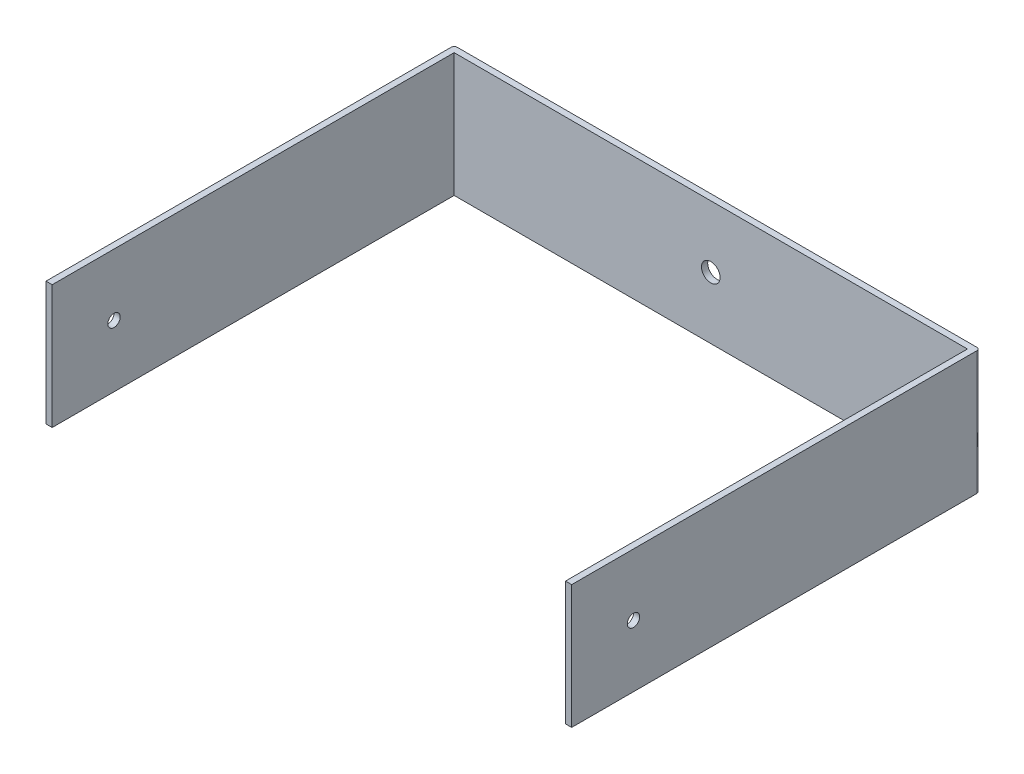
ISO-10303-21;
HEADER;
FILE_DESCRIPTION(('STEP AP214'),'2;1');
FILE_NAME('part.step','',(''),(''),'','','');
FILE_SCHEMA(('AUTOMOTIVE_DESIGN { 1 0 10303 214 1 1 1 1 }'));
ENDSEC;
DATA;
#1=APPLICATION_CONTEXT('core data for automotive mechanical design processes');
#2=APPLICATION_PROTOCOL_DEFINITION('international standard','automotive_design',2000,#1);
#3=PRODUCT_CONTEXT('',#1,'mechanical');
#4=PRODUCT('Part','Part','',(#3));
#5=PRODUCT_RELATED_PRODUCT_CATEGORY('part','',(#4));
#6=PRODUCT_DEFINITION_FORMATION('','',#4);
#7=PRODUCT_DEFINITION_CONTEXT('part definition',#1,'design');
#8=PRODUCT_DEFINITION('design','',#6,#7);
#9=PRODUCT_DEFINITION_SHAPE('','',#8);
#10=(LENGTH_UNIT() NAMED_UNIT(*) SI_UNIT(.MILLI.,.METRE.));
#11=(NAMED_UNIT(*) PLANE_ANGLE_UNIT() SI_UNIT($,.RADIAN.));
#12=(NAMED_UNIT(*) SI_UNIT($,.STERADIAN.) SOLID_ANGLE_UNIT());
#13=UNCERTAINTY_MEASURE_WITH_UNIT(LENGTH_MEASURE(1.E-05),#10,'distance_accuracy_value','');
#14=(GEOMETRIC_REPRESENTATION_CONTEXT(3) GLOBAL_UNCERTAINTY_ASSIGNED_CONTEXT((#13)) GLOBAL_UNIT_ASSIGNED_CONTEXT((#10,
#11,#12)) REPRESENTATION_CONTEXT('',''));
#15=CARTESIAN_POINT('',(0.,0.,0.));
#16=DIRECTION('',(0.,0.,1.));
#17=DIRECTION('',(1.,0.,0.));
#18=AXIS2_PLACEMENT_3D('',#15,#16,#17);
#19=CARTESIAN_POINT('',(0.,0.,2.));
#20=DIRECTION('',(0.,0.,1.));
#21=DIRECTION('',(1.,0.,0.));
#22=AXIS2_PLACEMENT_3D('',#19,#20,#21);
#23=PLANE('',#22);
#24=CARTESIAN_POINT('',(85.,-20.,2.));
#25=DIRECTION('',(0.,0.,1.));
#26=DIRECTION('',(1.,0.,0.));
#27=AXIS2_PLACEMENT_3D('',#24,#25,#26);
#28=CIRCLE('',#27,3.00000000000001);
#29=CARTESIAN_POINT('',(88.,-20.,2.));
#30=VERTEX_POINT('',#29);
#31=EDGE_CURVE('E384',#30,#30,#28,.T.);
#32=ORIENTED_EDGE('',*,*,#31,.F.);
#33=EDGE_LOOP('',(#32));
#34=FACE_BOUND('',#33,.T.);
#35=DIRECTION('',(1.,0.,0.));
#36=VECTOR('',#35,1.);
#37=CARTESIAN_POINT('',(0.,-40.,2.));
#38=LINE('',#37,#36);
#39=CARTESIAN_POINT('',(2.,-40.,2.));
#40=VERTEX_POINT('',#39);
#41=CARTESIAN_POINT('',(168.,-40.,2.));
#42=VERTEX_POINT('',#41);
#43=EDGE_CURVE('E168',#40,#42,#38,.T.);
#44=ORIENTED_EDGE('',*,*,#43,.T.);
#45=DIRECTION('',(0.,-1.,0.));
#46=VECTOR('',#45,1.);
#47=CARTESIAN_POINT('',(168.,0.,2.));
#48=LINE('',#47,#46);
#49=CARTESIAN_POINT('',(168.,0.,2.));
#50=VERTEX_POINT('',#49);
#51=EDGE_CURVE('E134',#50,#42,#48,.T.);
#52=ORIENTED_EDGE('',*,*,#51,.F.);
#53=DIRECTION('',(-1.,0.,0.));
#54=VECTOR('',#53,1.);
#55=CARTESIAN_POINT('',(0.,0.,2.));
#56=LINE('',#55,#54);
#57=CARTESIAN_POINT('',(2.,0.,2.));
#58=VERTEX_POINT('',#57);
#59=EDGE_CURVE('E180',#50,#58,#56,.T.);
#60=ORIENTED_EDGE('',*,*,#59,.T.);
#61=DIRECTION('',(0.,1.,0.));
#62=VECTOR('',#61,1.);
#63=CARTESIAN_POINT('',(2.,0.,2.));
#64=LINE('',#63,#62);
#65=EDGE_CURVE('E148',#40,#58,#64,.T.);
#66=ORIENTED_EDGE('',*,*,#65,.F.);
#67=EDGE_LOOP('',(#44,#52,#60,#66));
#68=FACE_BOUND('',#67,.T.);
#69=ADVANCED_FACE('F32',(#34,#68),#23,.T.);
#70=CARTESIAN_POINT('',(0.,0.,2.));
#71=DIRECTION('',(1.,0.,0.));
#72=DIRECTION('',(0.,1.,0.));
#73=AXIS2_PLACEMENT_3D('',#70,#71,#72);
#74=PLANE('',#73);
#75=CARTESIAN_POINT('',(0.,-20.,112.));
#76=DIRECTION('',(-1.,0.,0.));
#77=DIRECTION('',(0.,-1.,0.));
#78=AXIS2_PLACEMENT_3D('',#75,#76,#77);
#79=CIRCLE('',#78,2.);
#80=CARTESIAN_POINT('',(0.,-22.,112.));
#81=VERTEX_POINT('',#80);
#82=EDGE_CURVE('E387',#81,#81,#79,.T.);
#83=ORIENTED_EDGE('',*,*,#82,.F.);
#84=EDGE_LOOP('',(#83));
#85=FACE_BOUND('',#84,.T.);
#86=DIRECTION('',(0.,0.,-1.));
#87=VECTOR('',#86,1.);
#88=CARTESIAN_POINT('',(0.,0.,2.));
#89=LINE('',#88,#87);
#90=CARTESIAN_POINT('',(0.,0.,132.));
#91=VERTEX_POINT('',#90);
#92=CARTESIAN_POINT('',(0.,0.,1.));
#93=VERTEX_POINT('',#92);
#94=EDGE_CURVE('E118',#91,#93,#89,.T.);
#95=ORIENTED_EDGE('',*,*,#94,.T.);
#96=DIRECTION('',(0.,-1.,0.));
#97=VECTOR('',#96,1.);
#98=CARTESIAN_POINT('',(0.,0.,1.));
#99=LINE('',#98,#97);
#100=CARTESIAN_POINT('',(0.,-40.,1.));
#101=VERTEX_POINT('',#100);
#102=EDGE_CURVE('E193',#93,#101,#99,.T.);
#103=ORIENTED_EDGE('',*,*,#102,.T.);
#104=DIRECTION('',(0.,0.,-1.));
#105=VECTOR('',#104,1.);
#106=CARTESIAN_POINT('',(0.,-40.,2.));
#107=LINE('',#106,#105);
#108=CARTESIAN_POINT('',(0.,-40.,132.));
#109=VERTEX_POINT('',#108);
#110=EDGE_CURVE('E191',#109,#101,#107,.T.);
#111=ORIENTED_EDGE('',*,*,#110,.F.);
#112=DIRECTION('',(0.,-1.,0.));
#113=VECTOR('',#112,1.);
#114=CARTESIAN_POINT('',(0.,0.,132.));
#115=LINE('',#114,#113);
#116=EDGE_CURVE('E149',#91,#109,#115,.T.);
#117=ORIENTED_EDGE('',*,*,#116,.F.);
#118=EDGE_LOOP('',(#95,#103,#111,#117));
#119=FACE_BOUND('',#118,.T.);
#120=ADVANCED_FACE('F214',(#85,#119),#74,.F.);
#121=CARTESIAN_POINT('',(0.,-40.,2.));
#122=DIRECTION('',(0.,1.,0.));
#123=DIRECTION('',(0.,0.,1.));
#124=AXIS2_PLACEMENT_3D('',#121,#122,#123);
#125=PLANE('',#124);
#126=DIRECTION('',(1.,0.,0.));
#127=VECTOR('',#126,1.);
#128=CARTESIAN_POINT('',(0.,-40.,0.));
#129=LINE('',#128,#127);
#130=CARTESIAN_POINT('',(1.00000000000001,-40.,0.));
#131=VERTEX_POINT('',#130);
#132=CARTESIAN_POINT('',(169.,-40.,0.));
#133=VERTEX_POINT('',#132);
#134=EDGE_CURVE('E177',#131,#133,#129,.T.);
#135=ORIENTED_EDGE('',*,*,#134,.T.);
#136=CARTESIAN_POINT('',(169.,-40.,1.));
#137=DIRECTION('',(0.,1.,0.));
#138=DIRECTION('',(0.,0.,1.));
#139=AXIS2_PLACEMENT_3D('',#136,#137,#138);
#140=CIRCLE('',#139,1.);
#141=CARTESIAN_POINT('',(170.,-40.,1.));
#142=VERTEX_POINT('',#141);
#143=EDGE_CURVE('E11',#133,#142,#140,.F.);
#144=ORIENTED_EDGE('',*,*,#143,.T.);
#145=DIRECTION('',(0.,0.,-1.));
#146=VECTOR('',#145,1.);
#147=CARTESIAN_POINT('',(170.,-40.,2.));
#148=LINE('',#147,#146);
#149=CARTESIAN_POINT('',(170.,-40.,132.));
#150=VERTEX_POINT('',#149);
#151=EDGE_CURVE('E117',#150,#142,#148,.T.);
#152=ORIENTED_EDGE('',*,*,#151,.F.);
#153=DIRECTION('',(1.,0.,0.));
#154=VECTOR('',#153,1.);
#155=CARTESIAN_POINT('',(170.,-40.,132.));
#156=LINE('',#155,#154);
#157=CARTESIAN_POINT('',(168.,-40.,132.));
#158=VERTEX_POINT('',#157);
#159=EDGE_CURVE('E133',#158,#150,#156,.T.);
#160=ORIENTED_EDGE('',*,*,#159,.F.);
#161=DIRECTION('',(0.,0.,-1.));
#162=VECTOR('',#161,1.);
#163=CARTESIAN_POINT('',(168.,-40.,132.));
#164=LINE('',#163,#162);
#165=EDGE_CURVE('E143',#158,#42,#164,.T.);
#166=ORIENTED_EDGE('',*,*,#165,.T.);
#167=ORIENTED_EDGE('',*,*,#43,.F.);
#168=DIRECTION('',(0.,0.,-1.));
#169=VECTOR('',#168,1.);
#170=CARTESIAN_POINT('',(2.00000000000001,-40.,132.));
#171=LINE('',#170,#169);
#172=CARTESIAN_POINT('',(2.00000000000001,-40.,132.));
#173=VERTEX_POINT('',#172);
#174=EDGE_CURVE('E172',#173,#40,#171,.T.);
#175=ORIENTED_EDGE('',*,*,#174,.F.);
#176=DIRECTION('',(1.,0.,0.));
#177=VECTOR('',#176,1.);
#178=CARTESIAN_POINT('',(0.,-40.,132.));
#179=LINE('',#178,#177);
#180=EDGE_CURVE('E152',#109,#173,#179,.T.);
#181=ORIENTED_EDGE('',*,*,#180,.F.);
#182=ORIENTED_EDGE('',*,*,#110,.T.);
#183=CARTESIAN_POINT('',(1.00000000000001,-40.,1.));
#184=DIRECTION('',(0.,1.,0.));
#185=DIRECTION('',(0.,0.,1.));
#186=AXIS2_PLACEMENT_3D('',#183,#184,#185);
#187=CIRCLE('',#186,1.);
#188=EDGE_CURVE('E197',#101,#131,#187,.F.);
#189=ORIENTED_EDGE('',*,*,#188,.T.);
#190=EDGE_LOOP('',(#135,#144,#152,#160,#166,#167,#175,#181,#182,#189));
#191=FACE_BOUND('',#190,.T.);
#192=ADVANCED_FACE('F216',(#191),#125,.F.);
#193=CARTESIAN_POINT('',(170.,0.,2.));
#194=DIRECTION('',(-1.,0.,0.));
#195=DIRECTION('',(0.,0.,1.));
#196=AXIS2_PLACEMENT_3D('',#193,#194,#195);
#197=PLANE('',#196);
#198=CARTESIAN_POINT('',(170.,-20.,112.));
#199=DIRECTION('',(-1.,0.,0.));
#200=DIRECTION('',(0.,-1.,0.));
#201=AXIS2_PLACEMENT_3D('',#198,#199,#200);
#202=CIRCLE('',#201,2.);
#203=CARTESIAN_POINT('',(170.,-22.,112.));
#204=VERTEX_POINT('',#203);
#205=EDGE_CURVE('E388',#204,#204,#202,.T.);
#206=ORIENTED_EDGE('',*,*,#205,.T.);
#207=EDGE_LOOP('',(#206));
#208=FACE_BOUND('',#207,.T.);
#209=ORIENTED_EDGE('',*,*,#151,.T.);
#210=DIRECTION('',(0.,1.,0.));
#211=VECTOR('',#210,1.);
#212=CARTESIAN_POINT('',(170.,0.,1.));
#213=LINE('',#212,#211);
#214=CARTESIAN_POINT('',(170.,0.,1.));
#215=VERTEX_POINT('',#214);
#216=EDGE_CURVE('E116',#142,#215,#213,.T.);
#217=ORIENTED_EDGE('',*,*,#216,.T.);
#218=DIRECTION('',(0.,0.,-1.));
#219=VECTOR('',#218,1.);
#220=CARTESIAN_POINT('',(170.,0.,2.));
#221=LINE('',#220,#219);
#222=CARTESIAN_POINT('',(170.,0.,132.));
#223=VERTEX_POINT('',#222);
#224=EDGE_CURVE('E109',#223,#215,#221,.T.);
#225=ORIENTED_EDGE('',*,*,#224,.F.);
#226=DIRECTION('',(0.,1.,0.));
#227=VECTOR('',#226,1.);
#228=CARTESIAN_POINT('',(170.,0.,132.));
#229=LINE('',#228,#227);
#230=EDGE_CURVE('E114',#150,#223,#229,.T.);
#231=ORIENTED_EDGE('',*,*,#230,.F.);
#232=EDGE_LOOP('',(#209,#217,#225,#231));
#233=FACE_BOUND('',#232,.T.);
#234=ADVANCED_FACE('F112',(#208,#233),#197,.F.);
#235=CARTESIAN_POINT('',(0.,0.,2.));
#236=DIRECTION('',(0.,-1.,0.));
#237=DIRECTION('',(0.,0.,-1.));
#238=AXIS2_PLACEMENT_3D('',#235,#236,#237);
#239=PLANE('',#238);
#240=ORIENTED_EDGE('',*,*,#224,.T.);
#241=CARTESIAN_POINT('',(169.,0.,1.));
#242=DIRECTION('',(0.,-1.,0.));
#243=DIRECTION('',(0.,0.,-1.));
#244=AXIS2_PLACEMENT_3D('',#241,#242,#243);
#245=CIRCLE('',#244,1.);
#246=CARTESIAN_POINT('',(169.,0.,0.));
#247=VERTEX_POINT('',#246);
#248=EDGE_CURVE('E55',#215,#247,#245,.F.);
#249=ORIENTED_EDGE('',*,*,#248,.T.);
#250=DIRECTION('',(-1.,0.,0.));
#251=VECTOR('',#250,1.);
#252=CARTESIAN_POINT('',(0.,0.,0.));
#253=LINE('',#252,#251);
#254=CARTESIAN_POINT('',(1.,0.,0.));
#255=VERTEX_POINT('',#254);
#256=EDGE_CURVE('E187',#247,#255,#253,.T.);
#257=ORIENTED_EDGE('',*,*,#256,.T.);
#258=CARTESIAN_POINT('',(1.,0.,1.));
#259=DIRECTION('',(0.,-1.,0.));
#260=DIRECTION('',(0.,0.,-1.));
#261=AXIS2_PLACEMENT_3D('',#258,#259,#260);
#262=CIRCLE('',#261,1.);
#263=EDGE_CURVE('E205',#255,#93,#262,.F.);
#264=ORIENTED_EDGE('',*,*,#263,.T.);
#265=ORIENTED_EDGE('',*,*,#94,.F.);
#266=DIRECTION('',(-1.,0.,0.));
#267=VECTOR('',#266,1.);
#268=CARTESIAN_POINT('',(0.,0.,132.));
#269=LINE('',#268,#267);
#270=CARTESIAN_POINT('',(2.,0.,132.));
#271=VERTEX_POINT('',#270);
#272=EDGE_CURVE('E156',#271,#91,#269,.T.);
#273=ORIENTED_EDGE('',*,*,#272,.F.);
#274=DIRECTION('',(0.,0.,-1.));
#275=VECTOR('',#274,1.);
#276=CARTESIAN_POINT('',(2.,0.,132.));
#277=LINE('',#276,#275);
#278=EDGE_CURVE('E159',#271,#58,#277,.T.);
#279=ORIENTED_EDGE('',*,*,#278,.T.);
#280=ORIENTED_EDGE('',*,*,#59,.F.);
#281=DIRECTION('',(0.,0.,-1.));
#282=VECTOR('',#281,1.);
#283=CARTESIAN_POINT('',(168.,0.,132.));
#284=LINE('',#283,#282);
#285=CARTESIAN_POINT('',(168.,0.,132.));
#286=VERTEX_POINT('',#285);
#287=EDGE_CURVE('E125',#286,#50,#284,.T.);
#288=ORIENTED_EDGE('',*,*,#287,.F.);
#289=DIRECTION('',(-1.,0.,0.));
#290=VECTOR('',#289,1.);
#291=CARTESIAN_POINT('',(170.,0.,132.));
#292=LINE('',#291,#290);
#293=EDGE_CURVE('E121',#223,#286,#292,.T.);
#294=ORIENTED_EDGE('',*,*,#293,.F.);
#295=EDGE_LOOP('',(#240,#249,#257,#264,#265,#273,#279,#280,#288,#294));
#296=FACE_BOUND('',#295,.T.);
#297=ADVANCED_FACE('F122',(#296),#239,.F.);
#298=CARTESIAN_POINT('',(0.,0.,0.));
#299=DIRECTION('',(0.,0.,1.));
#300=DIRECTION('',(1.,0.,0.));
#301=AXIS2_PLACEMENT_3D('',#298,#299,#300);
#302=PLANE('',#301);
#303=CARTESIAN_POINT('',(85.,-20.,0.));
#304=DIRECTION('',(0.,0.,1.));
#305=DIRECTION('',(1.,0.,0.));
#306=AXIS2_PLACEMENT_3D('',#303,#304,#305);
#307=CIRCLE('',#306,3.00000000000001);
#308=CARTESIAN_POINT('',(88.,-20.,0.));
#309=VERTEX_POINT('',#308);
#310=EDGE_CURVE('E36',#309,#309,#307,.T.);
#311=ORIENTED_EDGE('',*,*,#310,.T.);
#312=EDGE_LOOP('',(#311));
#313=FACE_BOUND('',#312,.T.);
#314=ORIENTED_EDGE('',*,*,#256,.F.);
#315=DIRECTION('',(0.,1.,0.));
#316=VECTOR('',#315,1.);
#317=CARTESIAN_POINT('',(169.,0.,0.));
#318=LINE('',#317,#316);
#319=EDGE_CURVE('E41',#247,#133,#318,.F.);
#320=ORIENTED_EDGE('',*,*,#319,.T.);
#321=ORIENTED_EDGE('',*,*,#134,.F.);
#322=DIRECTION('',(0.,-1.,0.));
#323=VECTOR('',#322,1.);
#324=CARTESIAN_POINT('',(1.,0.,0.));
#325=LINE('',#324,#323);
#326=EDGE_CURVE('E200',#131,#255,#325,.F.);
#327=ORIENTED_EDGE('',*,*,#326,.T.);
#328=EDGE_LOOP('',(#314,#320,#321,#327));
#329=FACE_BOUND('',#328,.T.);
#330=ADVANCED_FACE('F218',(#313,#329),#302,.F.);
#331=CARTESIAN_POINT('',(2.,0.,132.));
#332=DIRECTION('',(-1.,0.,0.));
#333=DIRECTION('',(0.,-1.,0.));
#334=AXIS2_PLACEMENT_3D('',#331,#332,#333);
#335=PLANE('',#334);
#336=CARTESIAN_POINT('',(2.,-20.,112.));
#337=DIRECTION('',(-1.,0.,0.));
#338=DIRECTION('',(0.,-1.,0.));
#339=AXIS2_PLACEMENT_3D('',#336,#337,#338);
#340=CIRCLE('',#339,2.);
#341=CARTESIAN_POINT('',(2.,-22.,112.));
#342=VERTEX_POINT('',#341);
#343=EDGE_CURVE('E137',#342,#342,#340,.T.);
#344=ORIENTED_EDGE('',*,*,#343,.T.);
#345=EDGE_LOOP('',(#344));
#346=FACE_BOUND('',#345,.T.);
#347=ORIENTED_EDGE('',*,*,#65,.T.);
#348=ORIENTED_EDGE('',*,*,#278,.F.);
#349=DIRECTION('',(0.,1.,0.));
#350=VECTOR('',#349,1.);
#351=CARTESIAN_POINT('',(2.,0.,132.));
#352=LINE('',#351,#350);
#353=EDGE_CURVE('E154',#173,#271,#352,.T.);
#354=ORIENTED_EDGE('',*,*,#353,.F.);
#355=ORIENTED_EDGE('',*,*,#174,.T.);
#356=EDGE_LOOP('',(#347,#348,#354,#355));
#357=FACE_BOUND('',#356,.T.);
#358=ADVANCED_FACE('F229',(#346,#357),#335,.F.);
#359=CARTESIAN_POINT('',(0.,0.,132.));
#360=DIRECTION('',(0.,0.,1.));
#361=DIRECTION('',(1.,0.,0.));
#362=AXIS2_PLACEMENT_3D('',#359,#360,#361);
#363=PLANE('',#362);
#364=ORIENTED_EDGE('',*,*,#116,.T.);
#365=ORIENTED_EDGE('',*,*,#180,.T.);
#366=ORIENTED_EDGE('',*,*,#353,.T.);
#367=ORIENTED_EDGE('',*,*,#272,.T.);
#368=EDGE_LOOP('',(#364,#365,#366,#367));
#369=FACE_BOUND('',#368,.T.);
#370=ADVANCED_FACE('F231',(#369),#363,.T.);
#371=CARTESIAN_POINT('',(168.,0.,132.));
#372=DIRECTION('',(1.,0.,0.));
#373=DIRECTION('',(0.,0.,-1.));
#374=AXIS2_PLACEMENT_3D('',#371,#372,#373);
#375=PLANE('',#374);
#376=CARTESIAN_POINT('',(168.,-20.,112.));
#377=DIRECTION('',(1.,0.,0.));
#378=DIRECTION('',(0.,0.,-1.));
#379=AXIS2_PLACEMENT_3D('',#376,#377,#378);
#380=CIRCLE('',#379,2.);
#381=CARTESIAN_POINT('',(168.,-20.,110.));
#382=VERTEX_POINT('',#381);
#383=EDGE_CURVE('E182',#382,#382,#380,.T.);
#384=ORIENTED_EDGE('',*,*,#383,.T.);
#385=EDGE_LOOP('',(#384));
#386=FACE_BOUND('',#385,.T.);
#387=ORIENTED_EDGE('',*,*,#51,.T.);
#388=ORIENTED_EDGE('',*,*,#165,.F.);
#389=DIRECTION('',(0.,-1.,0.));
#390=VECTOR('',#389,1.);
#391=CARTESIAN_POINT('',(168.,0.,132.));
#392=LINE('',#391,#390);
#393=EDGE_CURVE('E128',#286,#158,#392,.T.);
#394=ORIENTED_EDGE('',*,*,#393,.F.);
#395=ORIENTED_EDGE('',*,*,#287,.T.);
#396=EDGE_LOOP('',(#387,#388,#394,#395));
#397=FACE_BOUND('',#396,.T.);
#398=ADVANCED_FACE('F224',(#386,#397),#375,.F.);
#399=CARTESIAN_POINT('',(0.,0.,132.));
#400=DIRECTION('',(0.,0.,-1.));
#401=DIRECTION('',(-1.,0.,0.));
#402=AXIS2_PLACEMENT_3D('',#399,#400,#401);
#403=PLANE('',#402);
#404=ORIENTED_EDGE('',*,*,#230,.T.);
#405=ORIENTED_EDGE('',*,*,#293,.T.);
#406=ORIENTED_EDGE('',*,*,#393,.T.);
#407=ORIENTED_EDGE('',*,*,#159,.T.);
#408=EDGE_LOOP('',(#404,#405,#406,#407));
#409=FACE_BOUND('',#408,.T.);
#410=ADVANCED_FACE('F131',(#409),#403,.F.);
#411=CARTESIAN_POINT('',(170.,-20.,112.));
#412=DIRECTION('',(-1.,0.,0.));
#413=DIRECTION('',(0.,-1.,0.));
#414=AXIS2_PLACEMENT_3D('',#411,#412,#413);
#415=CYLINDRICAL_SURFACE('',#414,2.);
#416=ORIENTED_EDGE('',*,*,#205,.F.);
#417=EDGE_LOOP('',(#416));
#418=FACE_BOUND('',#417,.T.);
#419=ORIENTED_EDGE('',*,*,#383,.F.);
#420=EDGE_LOOP('',(#419));
#421=FACE_BOUND('',#420,.T.);
#422=ADVANCED_FACE('F271',(#418,#421),#415,.F.);
#423=ORIENTED_EDGE('',*,*,#82,.T.);
#424=EDGE_LOOP('',(#423));
#425=FACE_BOUND('',#424,.T.);
#426=ORIENTED_EDGE('',*,*,#343,.F.);
#427=EDGE_LOOP('',(#426));
#428=FACE_BOUND('',#427,.T.);
#429=ADVANCED_FACE('F265',(#425,#428),#415,.F.);
#430=CARTESIAN_POINT('',(1.,0.,1.));
#431=DIRECTION('',(0.,-1.,0.));
#432=DIRECTION('',(1.,0.,0.));
#433=AXIS2_PLACEMENT_3D('',#430,#431,#432);
#434=CYLINDRICAL_SURFACE('',#433,1.);
#435=ORIENTED_EDGE('',*,*,#263,.F.);
#436=ORIENTED_EDGE('',*,*,#326,.F.);
#437=ORIENTED_EDGE('',*,*,#188,.F.);
#438=ORIENTED_EDGE('',*,*,#102,.F.);
#439=EDGE_LOOP('',(#435,#436,#437,#438));
#440=FACE_BOUND('',#439,.T.);
#441=ADVANCED_FACE('F215',(#440),#434,.T.);
#442=CARTESIAN_POINT('',(169.,0.,1.));
#443=DIRECTION('',(0.,1.,0.));
#444=DIRECTION('',(0.,0.,1.));
#445=AXIS2_PLACEMENT_3D('',#442,#443,#444);
#446=CYLINDRICAL_SURFACE('',#445,1.);
#447=ORIENTED_EDGE('',*,*,#143,.F.);
#448=ORIENTED_EDGE('',*,*,#319,.F.);
#449=ORIENTED_EDGE('',*,*,#248,.F.);
#450=ORIENTED_EDGE('',*,*,#216,.F.);
#451=EDGE_LOOP('',(#447,#448,#449,#450));
#452=FACE_BOUND('',#451,.T.);
#453=ADVANCED_FACE('F34',(#452),#446,.T.);
#454=CARTESIAN_POINT('',(85.,-20.,-128.));
#455=DIRECTION('',(0.,0.,1.));
#456=DIRECTION('',(1.,0.,0.));
#457=AXIS2_PLACEMENT_3D('',#454,#455,#456);
#458=CYLINDRICAL_SURFACE('',#457,3.00000000000001);
#459=ORIENTED_EDGE('',*,*,#31,.T.);
#460=EDGE_LOOP('',(#459));
#461=FACE_BOUND('',#460,.T.);
#462=ORIENTED_EDGE('',*,*,#310,.F.);
#463=EDGE_LOOP('',(#462));
#464=FACE_BOUND('',#463,.T.);
#465=ADVANCED_FACE('F270',(#461,#464),#458,.F.);
#466=CLOSED_SHELL('',(#69,#120,#192,#234,#297,#330,#358,#370,#398,#410,#422,#429,#441,#453,#465));
#467=MANIFOLD_SOLID_BREP('B2',#466);
#468=ADVANCED_BREP_SHAPE_REPRESENTATION('',(#18,#467),#14);
#469=SHAPE_DEFINITION_REPRESENTATION(#9,#468);
ENDSEC;
END-ISO-10303-21;
